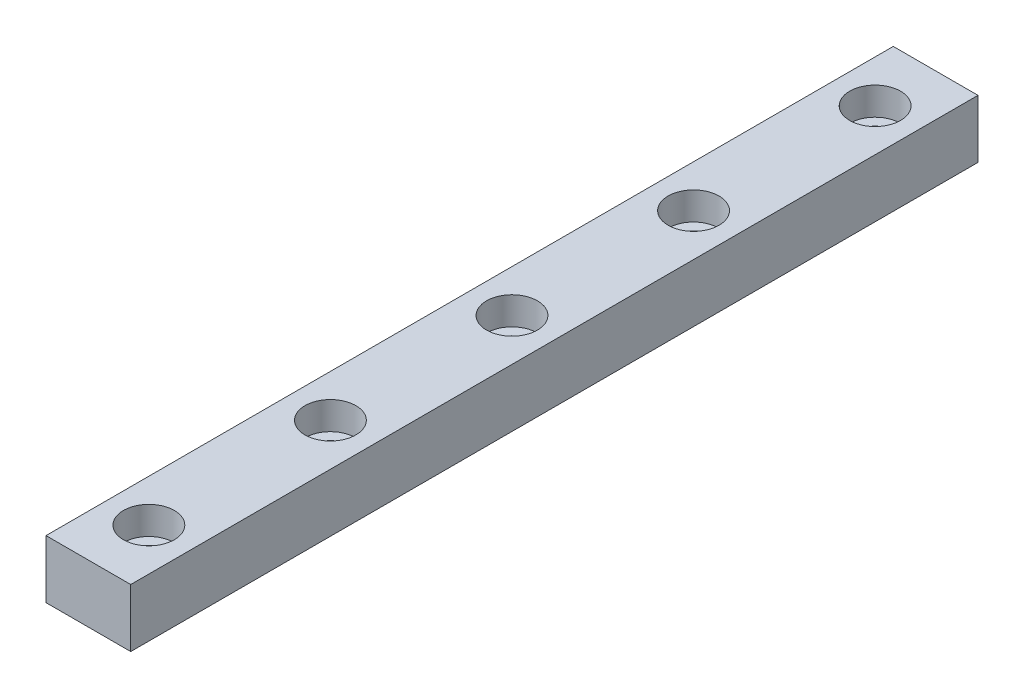
ISO-10303-21;
HEADER;
FILE_DESCRIPTION(('STEP AP214'),'2;1');
FILE_NAME('part.step','',(''),(''),'','','');
FILE_SCHEMA(('AUTOMOTIVE_DESIGN { 1 0 10303 214 1 1 1 1 }'));
ENDSEC;
DATA;
#1=APPLICATION_CONTEXT('core data for automotive mechanical design processes');
#2=APPLICATION_PROTOCOL_DEFINITION('international standard','automotive_design',2000,#1);
#3=PRODUCT_CONTEXT('',#1,'mechanical');
#4=PRODUCT('Part','Part','',(#3));
#5=PRODUCT_RELATED_PRODUCT_CATEGORY('part','',(#4));
#6=PRODUCT_DEFINITION_FORMATION('','',#4);
#7=PRODUCT_DEFINITION_CONTEXT('part definition',#1,'design');
#8=PRODUCT_DEFINITION('design','',#6,#7);
#9=PRODUCT_DEFINITION_SHAPE('','',#8);
#10=(LENGTH_UNIT() NAMED_UNIT(*) SI_UNIT(.MILLI.,.METRE.));
#11=(NAMED_UNIT(*) PLANE_ANGLE_UNIT() SI_UNIT($,.RADIAN.));
#12=(NAMED_UNIT(*) SI_UNIT($,.STERADIAN.) SOLID_ANGLE_UNIT());
#13=UNCERTAINTY_MEASURE_WITH_UNIT(LENGTH_MEASURE(1.E-05),#10,'distance_accuracy_value','');
#14=(GEOMETRIC_REPRESENTATION_CONTEXT(3) GLOBAL_UNCERTAINTY_ASSIGNED_CONTEXT((#13)) GLOBAL_UNIT_ASSIGNED_CONTEXT((#10,
#11,#12)) REPRESENTATION_CONTEXT('',''));
#15=CARTESIAN_POINT('',(0.,0.,0.));
#16=DIRECTION('',(0.,0.,1.));
#17=DIRECTION('',(1.,0.,0.));
#18=AXIS2_PLACEMENT_3D('',#15,#16,#17);
#19=CARTESIAN_POINT('',(0.,0.,70.));
#20=DIRECTION('',(1.,0.,0.));
#21=DIRECTION('',(0.,0.,-1.));
#22=AXIS2_PLACEMENT_3D('',#19,#20,#21);
#23=PLANE('',#22);
#24=DIRECTION('',(0.,-1.,0.));
#25=VECTOR('',#24,1.);
#26=CARTESIAN_POINT('',(0.,0.,0.));
#27=LINE('',#26,#25);
#28=CARTESIAN_POINT('',(0.,4.8,0.));
#29=VERTEX_POINT('',#28);
#30=CARTESIAN_POINT('',(0.,0.,0.));
#31=VERTEX_POINT('',#30);
#32=EDGE_CURVE('E115',#29,#31,#27,.T.);
#33=ORIENTED_EDGE('',*,*,#32,.T.);
#34=DIRECTION('',(0.,0.,-1.));
#35=VECTOR('',#34,1.);
#36=CARTESIAN_POINT('',(0.,0.,70.));
#37=LINE('',#36,#35);
#38=CARTESIAN_POINT('',(0.,0.,70.));
#39=VERTEX_POINT('',#38);
#40=EDGE_CURVE('E11',#39,#31,#37,.T.);
#41=ORIENTED_EDGE('',*,*,#40,.F.);
#42=DIRECTION('',(0.,-1.,0.));
#43=VECTOR('',#42,1.);
#44=CARTESIAN_POINT('',(0.,0.,70.));
#45=LINE('',#44,#43);
#46=CARTESIAN_POINT('',(0.,4.8,70.));
#47=VERTEX_POINT('',#46);
#48=EDGE_CURVE('E98',#47,#39,#45,.T.);
#49=ORIENTED_EDGE('',*,*,#48,.F.);
#50=DIRECTION('',(0.,0.,-1.));
#51=VECTOR('',#50,1.);
#52=CARTESIAN_POINT('',(0.,4.8,70.));
#53=LINE('',#52,#51);
#54=EDGE_CURVE('E111',#47,#29,#53,.T.);
#55=ORIENTED_EDGE('',*,*,#54,.T.);
#56=EDGE_LOOP('',(#33,#41,#49,#55));
#57=FACE_BOUND('',#56,.T.);
#58=ADVANCED_FACE('F39',(#57),#23,.F.);
#59=CARTESIAN_POINT('',(0.,0.,70.));
#60=DIRECTION('',(0.,1.,0.));
#61=DIRECTION('',(0.,0.,1.));
#62=AXIS2_PLACEMENT_3D('',#59,#60,#61);
#63=PLANE('',#62);
#64=CARTESIAN_POINT('',(3.5,0.,65.));
#65=DIRECTION('',(0.,1.,0.));
#66=DIRECTION('',(0.,0.,1.));
#67=AXIS2_PLACEMENT_3D('',#64,#65,#66);
#68=CIRCLE('',#67,1.2);
#69=CARTESIAN_POINT('',(3.5,0.,66.2));
#70=VERTEX_POINT('',#69);
#71=EDGE_CURVE('E200',#70,#70,#68,.T.);
#72=ORIENTED_EDGE('',*,*,#71,.T.);
#73=EDGE_LOOP('',(#72));
#74=FACE_BOUND('',#73,.T.);
#75=CARTESIAN_POINT('',(3.49999999999995,0.,50.));
#76=DIRECTION('',(0.,1.,0.));
#77=DIRECTION('',(0.,0.,1.));
#78=AXIS2_PLACEMENT_3D('',#75,#76,#77);
#79=CIRCLE('',#78,1.2);
#80=CARTESIAN_POINT('',(3.49999999999995,0.,51.2));
#81=VERTEX_POINT('',#80);
#82=EDGE_CURVE('E184',#81,#81,#79,.T.);
#83=ORIENTED_EDGE('',*,*,#82,.T.);
#84=EDGE_LOOP('',(#83));
#85=FACE_BOUND('',#84,.T.);
#86=CARTESIAN_POINT('',(3.4999999999999,0.,35.));
#87=DIRECTION('',(0.,1.,0.));
#88=DIRECTION('',(0.,0.,1.));
#89=AXIS2_PLACEMENT_3D('',#86,#87,#88);
#90=CIRCLE('',#89,1.2);
#91=CARTESIAN_POINT('',(3.4999999999999,0.,36.2));
#92=VERTEX_POINT('',#91);
#93=EDGE_CURVE('E168',#92,#92,#90,.T.);
#94=ORIENTED_EDGE('',*,*,#93,.T.);
#95=EDGE_LOOP('',(#94));
#96=FACE_BOUND('',#95,.T.);
#97=CARTESIAN_POINT('',(3.49999999999984,0.,20.));
#98=DIRECTION('',(0.,1.,0.));
#99=DIRECTION('',(0.,0.,1.));
#100=AXIS2_PLACEMENT_3D('',#97,#98,#99);
#101=CIRCLE('',#100,1.2);
#102=CARTESIAN_POINT('',(3.49999999999984,0.,21.2));
#103=VERTEX_POINT('',#102);
#104=EDGE_CURVE('E152',#103,#103,#101,.T.);
#105=ORIENTED_EDGE('',*,*,#104,.T.);
#106=EDGE_LOOP('',(#105));
#107=FACE_BOUND('',#106,.T.);
#108=CARTESIAN_POINT('',(3.49999999999979,0.,5.));
#109=DIRECTION('',(0.,1.,0.));
#110=DIRECTION('',(0.,0.,1.));
#111=AXIS2_PLACEMENT_3D('',#108,#109,#110);
#112=CIRCLE('',#111,1.2);
#113=CARTESIAN_POINT('',(3.49999999999979,0.,6.2));
#114=VERTEX_POINT('',#113);
#115=EDGE_CURVE('E119',#114,#114,#112,.T.);
#116=ORIENTED_EDGE('',*,*,#115,.T.);
#117=EDGE_LOOP('',(#116));
#118=FACE_BOUND('',#117,.T.);
#119=DIRECTION('',(1.,0.,0.));
#120=VECTOR('',#119,1.);
#121=CARTESIAN_POINT('',(0.,0.,0.));
#122=LINE('',#121,#120);
#123=CARTESIAN_POINT('',(7.,0.,0.));
#124=VERTEX_POINT('',#123);
#125=EDGE_CURVE('E103',#31,#124,#122,.T.);
#126=ORIENTED_EDGE('',*,*,#125,.T.);
#127=DIRECTION('',(0.,0.,-1.));
#128=VECTOR('',#127,1.);
#129=CARTESIAN_POINT('',(7.,0.,70.));
#130=LINE('',#129,#128);
#131=CARTESIAN_POINT('',(7.,0.,70.));
#132=VERTEX_POINT('',#131);
#133=EDGE_CURVE('E48',#132,#124,#130,.T.);
#134=ORIENTED_EDGE('',*,*,#133,.F.);
#135=DIRECTION('',(1.,0.,0.));
#136=VECTOR('',#135,1.);
#137=CARTESIAN_POINT('',(0.,0.,70.));
#138=LINE('',#137,#136);
#139=EDGE_CURVE('E92',#39,#132,#138,.T.);
#140=ORIENTED_EDGE('',*,*,#139,.F.);
#141=ORIENTED_EDGE('',*,*,#40,.T.);
#142=EDGE_LOOP('',(#126,#134,#140,#141));
#143=FACE_BOUND('',#142,.T.);
#144=ADVANCED_FACE('F102',(#74,#85,#96,#107,#118,#143),#63,.F.);
#145=CARTESIAN_POINT('',(7.,0.,70.));
#146=DIRECTION('',(-1.,0.,0.));
#147=DIRECTION('',(0.,0.,1.));
#148=AXIS2_PLACEMENT_3D('',#145,#146,#147);
#149=PLANE('',#148);
#150=DIRECTION('',(0.,1.,0.));
#151=VECTOR('',#150,1.);
#152=CARTESIAN_POINT('',(7.,0.,0.));
#153=LINE('',#152,#151);
#154=CARTESIAN_POINT('',(7.,4.8,0.));
#155=VERTEX_POINT('',#154);
#156=EDGE_CURVE('E79',#124,#155,#153,.T.);
#157=ORIENTED_EDGE('',*,*,#156,.T.);
#158=DIRECTION('',(0.,0.,-1.));
#159=VECTOR('',#158,1.);
#160=CARTESIAN_POINT('',(7.,4.8,70.));
#161=LINE('',#160,#159);
#162=CARTESIAN_POINT('',(7.,4.8,70.));
#163=VERTEX_POINT('',#162);
#164=EDGE_CURVE('E105',#163,#155,#161,.T.);
#165=ORIENTED_EDGE('',*,*,#164,.F.);
#166=DIRECTION('',(0.,1.,0.));
#167=VECTOR('',#166,1.);
#168=CARTESIAN_POINT('',(7.,0.,70.));
#169=LINE('',#168,#167);
#170=EDGE_CURVE('E96',#132,#163,#169,.T.);
#171=ORIENTED_EDGE('',*,*,#170,.F.);
#172=ORIENTED_EDGE('',*,*,#133,.T.);
#173=EDGE_LOOP('',(#157,#165,#171,#172));
#174=FACE_BOUND('',#173,.T.);
#175=ADVANCED_FACE('F106',(#174),#149,.F.);
#176=CARTESIAN_POINT('',(0.,4.8,70.));
#177=DIRECTION('',(0.,-1.,0.));
#178=DIRECTION('',(0.,0.,-1.));
#179=AXIS2_PLACEMENT_3D('',#176,#177,#178);
#180=PLANE('',#179);
#181=CARTESIAN_POINT('',(3.5,4.8,65.));
#182=DIRECTION('',(0.,1.,0.));
#183=DIRECTION('',(0.,0.,1.));
#184=AXIS2_PLACEMENT_3D('',#181,#182,#183);
#185=CIRCLE('',#184,2.1);
#186=CARTESIAN_POINT('',(3.5,4.8,67.1));
#187=VERTEX_POINT('',#186);
#188=EDGE_CURVE('E211',#187,#187,#185,.T.);
#189=ORIENTED_EDGE('',*,*,#188,.F.);
#190=EDGE_LOOP('',(#189));
#191=FACE_BOUND('',#190,.T.);
#192=CARTESIAN_POINT('',(3.49999999999995,4.8,50.));
#193=DIRECTION('',(0.,1.,0.));
#194=DIRECTION('',(0.,0.,1.));
#195=AXIS2_PLACEMENT_3D('',#192,#193,#194);
#196=CIRCLE('',#195,2.1);
#197=CARTESIAN_POINT('',(3.49999999999995,4.8,52.1));
#198=VERTEX_POINT('',#197);
#199=EDGE_CURVE('E196',#198,#198,#196,.T.);
#200=ORIENTED_EDGE('',*,*,#199,.F.);
#201=EDGE_LOOP('',(#200));
#202=FACE_BOUND('',#201,.T.);
#203=CARTESIAN_POINT('',(3.4999999999999,4.8,35.));
#204=DIRECTION('',(0.,1.,0.));
#205=DIRECTION('',(0.,0.,1.));
#206=AXIS2_PLACEMENT_3D('',#203,#204,#205);
#207=CIRCLE('',#206,2.1);
#208=CARTESIAN_POINT('',(3.4999999999999,4.8,37.1));
#209=VERTEX_POINT('',#208);
#210=EDGE_CURVE('E180',#209,#209,#207,.T.);
#211=ORIENTED_EDGE('',*,*,#210,.F.);
#212=EDGE_LOOP('',(#211));
#213=FACE_BOUND('',#212,.T.);
#214=CARTESIAN_POINT('',(3.49999999999984,4.8,20.));
#215=DIRECTION('',(0.,1.,0.));
#216=DIRECTION('',(0.,0.,1.));
#217=AXIS2_PLACEMENT_3D('',#214,#215,#216);
#218=CIRCLE('',#217,2.1);
#219=CARTESIAN_POINT('',(3.49999999999984,4.8,22.1));
#220=VERTEX_POINT('',#219);
#221=EDGE_CURVE('E164',#220,#220,#218,.T.);
#222=ORIENTED_EDGE('',*,*,#221,.F.);
#223=EDGE_LOOP('',(#222));
#224=FACE_BOUND('',#223,.T.);
#225=CARTESIAN_POINT('',(3.49999999999979,4.8,5.));
#226=DIRECTION('',(0.,1.,0.));
#227=DIRECTION('',(0.,0.,1.));
#228=AXIS2_PLACEMENT_3D('',#225,#226,#227);
#229=CIRCLE('',#228,2.1);
#230=CARTESIAN_POINT('',(3.49999999999979,4.8,7.1));
#231=VERTEX_POINT('',#230);
#232=EDGE_CURVE('E148',#231,#231,#229,.T.);
#233=ORIENTED_EDGE('',*,*,#232,.F.);
#234=EDGE_LOOP('',(#233));
#235=FACE_BOUND('',#234,.T.);
#236=DIRECTION('',(-1.,0.,0.));
#237=VECTOR('',#236,1.);
#238=CARTESIAN_POINT('',(0.,4.8,0.));
#239=LINE('',#238,#237);
#240=EDGE_CURVE('E85',#155,#29,#239,.T.);
#241=ORIENTED_EDGE('',*,*,#240,.T.);
#242=ORIENTED_EDGE('',*,*,#54,.F.);
#243=DIRECTION('',(-1.,0.,0.));
#244=VECTOR('',#243,1.);
#245=CARTESIAN_POINT('',(0.,4.8,70.));
#246=LINE('',#245,#244);
#247=EDGE_CURVE('E59',#163,#47,#246,.T.);
#248=ORIENTED_EDGE('',*,*,#247,.F.);
#249=ORIENTED_EDGE('',*,*,#164,.T.);
#250=EDGE_LOOP('',(#241,#242,#248,#249));
#251=FACE_BOUND('',#250,.T.);
#252=ADVANCED_FACE('F129',(#191,#202,#213,#224,#235,#251),#180,.F.);
#253=CARTESIAN_POINT('',(0.,0.,70.));
#254=DIRECTION('',(0.,0.,-1.));
#255=DIRECTION('',(-1.,0.,0.));
#256=AXIS2_PLACEMENT_3D('',#253,#254,#255);
#257=PLANE('',#256);
#258=ORIENTED_EDGE('',*,*,#48,.T.);
#259=ORIENTED_EDGE('',*,*,#139,.T.);
#260=ORIENTED_EDGE('',*,*,#170,.T.);
#261=ORIENTED_EDGE('',*,*,#247,.T.);
#262=EDGE_LOOP('',(#258,#259,#260,#261));
#263=FACE_BOUND('',#262,.T.);
#264=ADVANCED_FACE('F94',(#263),#257,.F.);
#265=CARTESIAN_POINT('',(0.,0.,0.));
#266=DIRECTION('',(0.,0.,-1.));
#267=DIRECTION('',(-1.,0.,0.));
#268=AXIS2_PLACEMENT_3D('',#265,#266,#267);
#269=PLANE('',#268);
#270=ORIENTED_EDGE('',*,*,#32,.F.);
#271=ORIENTED_EDGE('',*,*,#240,.F.);
#272=ORIENTED_EDGE('',*,*,#156,.F.);
#273=ORIENTED_EDGE('',*,*,#125,.F.);
#274=EDGE_LOOP('',(#270,#271,#272,#273));
#275=FACE_BOUND('',#274,.T.);
#276=ADVANCED_FACE('F132',(#275),#269,.T.);
#277=CARTESIAN_POINT('',(3.49999999999979,4.8,5.));
#278=DIRECTION('',(0.,1.,0.));
#279=DIRECTION('',(0.,0.,1.));
#280=AXIS2_PLACEMENT_3D('',#277,#278,#279);
#281=CYLINDRICAL_SURFACE('',#280,1.2);
#282=ORIENTED_EDGE('',*,*,#115,.F.);
#283=EDGE_LOOP('',(#282));
#284=FACE_BOUND('',#283,.T.);
#285=CARTESIAN_POINT('',(3.49999999999979,2.5,5.));
#286=DIRECTION('',(0.,1.,0.));
#287=DIRECTION('',(0.,0.,1.));
#288=AXIS2_PLACEMENT_3D('',#285,#286,#287);
#289=CIRCLE('',#288,1.2);
#290=CARTESIAN_POINT('',(3.49999999999979,2.5,6.2));
#291=VERTEX_POINT('',#290);
#292=EDGE_CURVE('E140',#291,#291,#289,.T.);
#293=ORIENTED_EDGE('',*,*,#292,.T.);
#294=EDGE_LOOP('',(#293));
#295=FACE_BOUND('',#294,.T.);
#296=ADVANCED_FACE('F241',(#284,#295),#281,.F.);
#297=CARTESIAN_POINT('',(4.69999999999979,2.5,5.));
#298=DIRECTION('',(0.,-1.,0.));
#299=DIRECTION('',(0.,0.,-1.));
#300=AXIS2_PLACEMENT_3D('',#297,#298,#299);
#301=PLANE('',#300);
#302=ORIENTED_EDGE('',*,*,#292,.F.);
#303=EDGE_LOOP('',(#302));
#304=FACE_BOUND('',#303,.T.);
#305=CARTESIAN_POINT('',(3.49999999999979,2.5,5.));
#306=DIRECTION('',(0.,1.,0.));
#307=DIRECTION('',(0.,0.,1.));
#308=AXIS2_PLACEMENT_3D('',#305,#306,#307);
#309=CIRCLE('',#308,2.1);
#310=CARTESIAN_POINT('',(3.49999999999979,2.5,7.1));
#311=VERTEX_POINT('',#310);
#312=EDGE_CURVE('E144',#311,#311,#309,.T.);
#313=ORIENTED_EDGE('',*,*,#312,.T.);
#314=EDGE_LOOP('',(#313));
#315=FACE_BOUND('',#314,.T.);
#316=ADVANCED_FACE('F231',(#304,#315),#301,.F.);
#317=CARTESIAN_POINT('',(3.49999999999979,4.8,5.));
#318=DIRECTION('',(0.,1.,0.));
#319=DIRECTION('',(0.,0.,1.));
#320=AXIS2_PLACEMENT_3D('',#317,#318,#319);
#321=CYLINDRICAL_SURFACE('',#320,2.1);
#322=ORIENTED_EDGE('',*,*,#312,.F.);
#323=EDGE_LOOP('',(#322));
#324=FACE_BOUND('',#323,.T.);
#325=ORIENTED_EDGE('',*,*,#232,.T.);
#326=EDGE_LOOP('',(#325));
#327=FACE_BOUND('',#326,.T.);
#328=ADVANCED_FACE('F228',(#324,#327),#321,.F.);
#329=CARTESIAN_POINT('',(3.49999999999984,4.8,20.));
#330=DIRECTION('',(0.,1.,0.));
#331=DIRECTION('',(0.,0.,1.));
#332=AXIS2_PLACEMENT_3D('',#329,#330,#331);
#333=CYLINDRICAL_SURFACE('',#332,1.2);
#334=ORIENTED_EDGE('',*,*,#104,.F.);
#335=EDGE_LOOP('',(#334));
#336=FACE_BOUND('',#335,.T.);
#337=CARTESIAN_POINT('',(3.49999999999984,2.5,20.));
#338=DIRECTION('',(0.,1.,0.));
#339=DIRECTION('',(0.,0.,1.));
#340=AXIS2_PLACEMENT_3D('',#337,#338,#339);
#341=CIRCLE('',#340,1.2);
#342=CARTESIAN_POINT('',(3.49999999999984,2.5,21.2));
#343=VERTEX_POINT('',#342);
#344=EDGE_CURVE('E156',#343,#343,#341,.T.);
#345=ORIENTED_EDGE('',*,*,#344,.T.);
#346=EDGE_LOOP('',(#345));
#347=FACE_BOUND('',#346,.T.);
#348=ADVANCED_FACE('F230',(#336,#347),#333,.F.);
#349=CARTESIAN_POINT('',(4.69999999999984,2.5,20.));
#350=DIRECTION('',(0.,-1.,0.));
#351=DIRECTION('',(0.,0.,-1.));
#352=AXIS2_PLACEMENT_3D('',#349,#350,#351);
#353=PLANE('',#352);
#354=ORIENTED_EDGE('',*,*,#344,.F.);
#355=EDGE_LOOP('',(#354));
#356=FACE_BOUND('',#355,.T.);
#357=CARTESIAN_POINT('',(3.49999999999984,2.5,20.));
#358=DIRECTION('',(0.,1.,0.));
#359=DIRECTION('',(0.,0.,1.));
#360=AXIS2_PLACEMENT_3D('',#357,#358,#359);
#361=CIRCLE('',#360,2.1);
#362=CARTESIAN_POINT('',(3.49999999999984,2.5,22.1));
#363=VERTEX_POINT('',#362);
#364=EDGE_CURVE('E160',#363,#363,#361,.T.);
#365=ORIENTED_EDGE('',*,*,#364,.T.);
#366=EDGE_LOOP('',(#365));
#367=FACE_BOUND('',#366,.T.);
#368=ADVANCED_FACE('F238',(#356,#367),#353,.F.);
#369=CARTESIAN_POINT('',(3.49999999999984,4.8,20.));
#370=DIRECTION('',(0.,1.,0.));
#371=DIRECTION('',(0.,0.,1.));
#372=AXIS2_PLACEMENT_3D('',#369,#370,#371);
#373=CYLINDRICAL_SURFACE('',#372,2.1);
#374=ORIENTED_EDGE('',*,*,#364,.F.);
#375=EDGE_LOOP('',(#374));
#376=FACE_BOUND('',#375,.T.);
#377=ORIENTED_EDGE('',*,*,#221,.T.);
#378=EDGE_LOOP('',(#377));
#379=FACE_BOUND('',#378,.T.);
#380=ADVANCED_FACE('F295',(#376,#379),#373,.F.);
#381=CARTESIAN_POINT('',(3.4999999999999,4.8,35.));
#382=DIRECTION('',(0.,1.,0.));
#383=DIRECTION('',(0.,0.,1.));
#384=AXIS2_PLACEMENT_3D('',#381,#382,#383);
#385=CYLINDRICAL_SURFACE('',#384,1.2);
#386=ORIENTED_EDGE('',*,*,#93,.F.);
#387=EDGE_LOOP('',(#386));
#388=FACE_BOUND('',#387,.T.);
#389=CARTESIAN_POINT('',(3.4999999999999,2.5,35.));
#390=DIRECTION('',(0.,1.,0.));
#391=DIRECTION('',(0.,0.,1.));
#392=AXIS2_PLACEMENT_3D('',#389,#390,#391);
#393=CIRCLE('',#392,1.2);
#394=CARTESIAN_POINT('',(3.4999999999999,2.5,36.2));
#395=VERTEX_POINT('',#394);
#396=EDGE_CURVE('E172',#395,#395,#393,.T.);
#397=ORIENTED_EDGE('',*,*,#396,.T.);
#398=EDGE_LOOP('',(#397));
#399=FACE_BOUND('',#398,.T.);
#400=ADVANCED_FACE('F305',(#388,#399),#385,.F.);
#401=CARTESIAN_POINT('',(4.6999999999999,2.5,35.));
#402=DIRECTION('',(0.,-1.,0.));
#403=DIRECTION('',(0.,0.,-1.));
#404=AXIS2_PLACEMENT_3D('',#401,#402,#403);
#405=PLANE('',#404);
#406=ORIENTED_EDGE('',*,*,#396,.F.);
#407=EDGE_LOOP('',(#406));
#408=FACE_BOUND('',#407,.T.);
#409=CARTESIAN_POINT('',(3.4999999999999,2.5,35.));
#410=DIRECTION('',(0.,1.,0.));
#411=DIRECTION('',(0.,0.,1.));
#412=AXIS2_PLACEMENT_3D('',#409,#410,#411);
#413=CIRCLE('',#412,2.1);
#414=CARTESIAN_POINT('',(3.4999999999999,2.5,37.1));
#415=VERTEX_POINT('',#414);
#416=EDGE_CURVE('E176',#415,#415,#413,.T.);
#417=ORIENTED_EDGE('',*,*,#416,.T.);
#418=EDGE_LOOP('',(#417));
#419=FACE_BOUND('',#418,.T.);
#420=ADVANCED_FACE('F315',(#408,#419),#405,.F.);
#421=CARTESIAN_POINT('',(3.4999999999999,4.8,35.));
#422=DIRECTION('',(0.,1.,0.));
#423=DIRECTION('',(0.,0.,1.));
#424=AXIS2_PLACEMENT_3D('',#421,#422,#423);
#425=CYLINDRICAL_SURFACE('',#424,2.1);
#426=ORIENTED_EDGE('',*,*,#416,.F.);
#427=EDGE_LOOP('',(#426));
#428=FACE_BOUND('',#427,.T.);
#429=ORIENTED_EDGE('',*,*,#210,.T.);
#430=EDGE_LOOP('',(#429));
#431=FACE_BOUND('',#430,.T.);
#432=ADVANCED_FACE('F326',(#428,#431),#425,.F.);
#433=CARTESIAN_POINT('',(3.49999999999995,4.8,50.));
#434=DIRECTION('',(0.,1.,0.));
#435=DIRECTION('',(0.,0.,1.));
#436=AXIS2_PLACEMENT_3D('',#433,#434,#435);
#437=CYLINDRICAL_SURFACE('',#436,1.2);
#438=ORIENTED_EDGE('',*,*,#82,.F.);
#439=EDGE_LOOP('',(#438));
#440=FACE_BOUND('',#439,.T.);
#441=CARTESIAN_POINT('',(3.49999999999995,2.5,50.));
#442=DIRECTION('',(0.,1.,0.));
#443=DIRECTION('',(0.,0.,1.));
#444=AXIS2_PLACEMENT_3D('',#441,#442,#443);
#445=CIRCLE('',#444,1.2);
#446=CARTESIAN_POINT('',(3.49999999999995,2.5,51.2));
#447=VERTEX_POINT('',#446);
#448=EDGE_CURVE('E188',#447,#447,#445,.T.);
#449=ORIENTED_EDGE('',*,*,#448,.T.);
#450=EDGE_LOOP('',(#449));
#451=FACE_BOUND('',#450,.T.);
#452=ADVANCED_FACE('F337',(#440,#451),#437,.F.);
#453=CARTESIAN_POINT('',(4.69999999999995,2.5,50.));
#454=DIRECTION('',(0.,-1.,0.));
#455=DIRECTION('',(0.,0.,-1.));
#456=AXIS2_PLACEMENT_3D('',#453,#454,#455);
#457=PLANE('',#456);
#458=ORIENTED_EDGE('',*,*,#448,.F.);
#459=EDGE_LOOP('',(#458));
#460=FACE_BOUND('',#459,.T.);
#461=CARTESIAN_POINT('',(3.49999999999995,2.5,50.));
#462=DIRECTION('',(0.,1.,0.));
#463=DIRECTION('',(0.,0.,1.));
#464=AXIS2_PLACEMENT_3D('',#461,#462,#463);
#465=CIRCLE('',#464,2.1);
#466=CARTESIAN_POINT('',(3.49999999999995,2.5,52.1));
#467=VERTEX_POINT('',#466);
#468=EDGE_CURVE('E192',#467,#467,#465,.T.);
#469=ORIENTED_EDGE('',*,*,#468,.T.);
#470=EDGE_LOOP('',(#469));
#471=FACE_BOUND('',#470,.T.);
#472=ADVANCED_FACE('F347',(#460,#471),#457,.F.);
#473=CARTESIAN_POINT('',(3.49999999999995,4.8,50.));
#474=DIRECTION('',(0.,1.,0.));
#475=DIRECTION('',(0.,0.,1.));
#476=AXIS2_PLACEMENT_3D('',#473,#474,#475);
#477=CYLINDRICAL_SURFACE('',#476,2.1);
#478=ORIENTED_EDGE('',*,*,#468,.F.);
#479=EDGE_LOOP('',(#478));
#480=FACE_BOUND('',#479,.T.);
#481=ORIENTED_EDGE('',*,*,#199,.T.);
#482=EDGE_LOOP('',(#481));
#483=FACE_BOUND('',#482,.T.);
#484=ADVANCED_FACE('F357',(#480,#483),#477,.F.);
#485=CARTESIAN_POINT('',(3.5,4.8,65.));
#486=DIRECTION('',(0.,1.,0.));
#487=DIRECTION('',(0.,0.,1.));
#488=AXIS2_PLACEMENT_3D('',#485,#486,#487);
#489=CYLINDRICAL_SURFACE('',#488,1.2);
#490=ORIENTED_EDGE('',*,*,#71,.F.);
#491=EDGE_LOOP('',(#490));
#492=FACE_BOUND('',#491,.T.);
#493=CARTESIAN_POINT('',(3.5,2.5,65.));
#494=DIRECTION('',(0.,1.,0.));
#495=DIRECTION('',(0.,0.,1.));
#496=AXIS2_PLACEMENT_3D('',#493,#494,#495);
#497=CIRCLE('',#496,1.2);
#498=CARTESIAN_POINT('',(3.5,2.5,66.2));
#499=VERTEX_POINT('',#498);
#500=EDGE_CURVE('E203',#499,#499,#497,.T.);
#501=ORIENTED_EDGE('',*,*,#500,.T.);
#502=EDGE_LOOP('',(#501));
#503=FACE_BOUND('',#502,.T.);
#504=ADVANCED_FACE('F367',(#492,#503),#489,.F.);
#505=CARTESIAN_POINT('',(4.7,2.5,65.));
#506=DIRECTION('',(0.,-1.,0.));
#507=DIRECTION('',(0.,0.,-1.));
#508=AXIS2_PLACEMENT_3D('',#505,#506,#507);
#509=PLANE('',#508);
#510=ORIENTED_EDGE('',*,*,#500,.F.);
#511=EDGE_LOOP('',(#510));
#512=FACE_BOUND('',#511,.T.);
#513=CARTESIAN_POINT('',(3.5,2.5,65.));
#514=DIRECTION('',(0.,1.,0.));
#515=DIRECTION('',(0.,0.,1.));
#516=AXIS2_PLACEMENT_3D('',#513,#514,#515);
#517=CIRCLE('',#516,2.1);
#518=CARTESIAN_POINT('',(3.5,2.5,67.1));
#519=VERTEX_POINT('',#518);
#520=EDGE_CURVE('E207',#519,#519,#517,.T.);
#521=ORIENTED_EDGE('',*,*,#520,.T.);
#522=EDGE_LOOP('',(#521));
#523=FACE_BOUND('',#522,.T.);
#524=ADVANCED_FACE('F378',(#512,#523),#509,.F.);
#525=CARTESIAN_POINT('',(3.5,4.8,65.));
#526=DIRECTION('',(0.,1.,0.));
#527=DIRECTION('',(0.,0.,1.));
#528=AXIS2_PLACEMENT_3D('',#525,#526,#527);
#529=CYLINDRICAL_SURFACE('',#528,2.1);
#530=ORIENTED_EDGE('',*,*,#520,.F.);
#531=EDGE_LOOP('',(#530));
#532=FACE_BOUND('',#531,.T.);
#533=ORIENTED_EDGE('',*,*,#188,.T.);
#534=EDGE_LOOP('',(#533));
#535=FACE_BOUND('',#534,.T.);
#536=ADVANCED_FACE('F215',(#532,#535),#529,.F.);
#537=CLOSED_SHELL('',(#58,#144,#175,#252,#264,#276,#296,#316,#328,#348,#368,#380,#400,#420,#432,
#452,#472,#484,#504,#524,#536));
#538=MANIFOLD_SOLID_BREP('B2',#537);
#539=ADVANCED_BREP_SHAPE_REPRESENTATION('',(#18,#538),#14);
#540=SHAPE_DEFINITION_REPRESENTATION(#9,#539);
ENDSEC;
END-ISO-10303-21;
